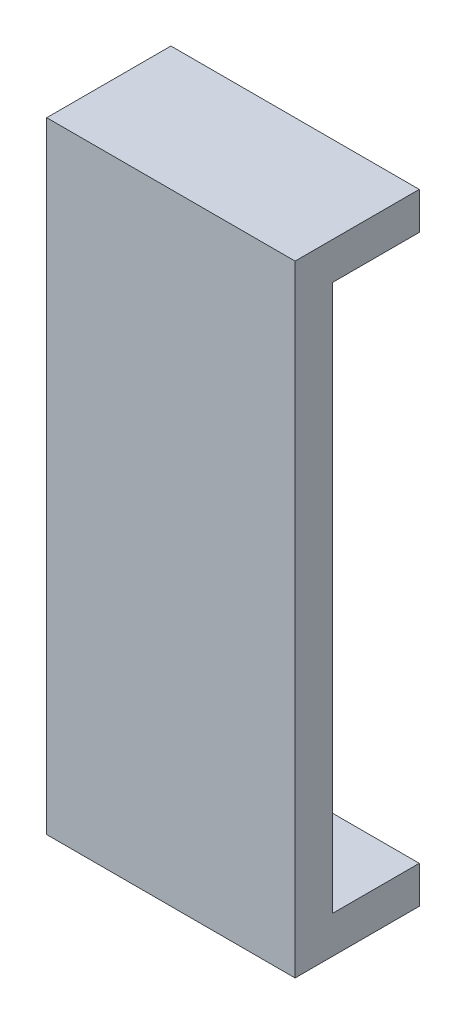
ISO-10303-21;
HEADER;
FILE_DESCRIPTION(('STEP AP214'),'2;1');
FILE_NAME('part.step','',(''),(''),'','','');
FILE_SCHEMA(('AUTOMOTIVE_DESIGN { 1 0 10303 214 1 1 1 1 }'));
ENDSEC;
DATA;
#1=APPLICATION_CONTEXT('core data for automotive mechanical design processes');
#2=APPLICATION_PROTOCOL_DEFINITION('international standard','automotive_design',2000,#1);
#3=PRODUCT_CONTEXT('',#1,'mechanical');
#4=PRODUCT('Part','Part','',(#3));
#5=PRODUCT_RELATED_PRODUCT_CATEGORY('part','',(#4));
#6=PRODUCT_DEFINITION_FORMATION('','',#4);
#7=PRODUCT_DEFINITION_CONTEXT('part definition',#1,'design');
#8=PRODUCT_DEFINITION('design','',#6,#7);
#9=PRODUCT_DEFINITION_SHAPE('','',#8);
#10=(LENGTH_UNIT() NAMED_UNIT(*) SI_UNIT(.MILLI.,.METRE.));
#11=(NAMED_UNIT(*) PLANE_ANGLE_UNIT() SI_UNIT($,.RADIAN.));
#12=(NAMED_UNIT(*) SI_UNIT($,.STERADIAN.) SOLID_ANGLE_UNIT());
#13=UNCERTAINTY_MEASURE_WITH_UNIT(LENGTH_MEASURE(1.E-05),#10,'distance_accuracy_value','');
#14=(GEOMETRIC_REPRESENTATION_CONTEXT(3) GLOBAL_UNCERTAINTY_ASSIGNED_CONTEXT((#13)) GLOBAL_UNIT_ASSIGNED_CONTEXT((#10,
#11,#12)) REPRESENTATION_CONTEXT('',''));
#15=CARTESIAN_POINT('',(0.,0.,0.));
#16=DIRECTION('',(0.,0.,1.));
#17=DIRECTION('',(1.,0.,0.));
#18=AXIS2_PLACEMENT_3D('',#15,#16,#17);
#19=CARTESIAN_POINT('',(0.,0.,0.));
#20=DIRECTION('',(0.,0.,1.));
#21=DIRECTION('',(1.,0.,0.));
#22=AXIS2_PLACEMENT_3D('',#19,#20,#21);
#23=PLANE('',#22);
#24=DIRECTION('',(1.,0.,0.));
#25=VECTOR('',#24,1.);
#26=CARTESIAN_POINT('',(-10.,-22.,0.));
#27=LINE('',#26,#25);
#28=CARTESIAN_POINT('',(-10.,-22.,0.));
#29=VERTEX_POINT('',#28);
#30=CARTESIAN_POINT('',(10.,-22.,0.));
#31=VERTEX_POINT('',#30);
#32=EDGE_CURVE('E121',#29,#31,#27,.T.);
#33=ORIENTED_EDGE('',*,*,#32,.F.);
#34=DIRECTION('',(0.,-1.,0.));
#35=VECTOR('',#34,1.);
#36=CARTESIAN_POINT('',(-10.,25.,0.));
#37=LINE('',#36,#35);
#38=CARTESIAN_POINT('',(-10.,22.,0.));
#39=VERTEX_POINT('',#38);
#40=EDGE_CURVE('E126',#39,#29,#37,.T.);
#41=ORIENTED_EDGE('',*,*,#40,.F.);
#42=DIRECTION('',(-1.,0.,0.));
#43=VECTOR('',#42,1.);
#44=CARTESIAN_POINT('',(9.99999999999999,22.,0.));
#45=LINE('',#44,#43);
#46=CARTESIAN_POINT('',(9.99999999999999,22.,0.));
#47=VERTEX_POINT('',#46);
#48=EDGE_CURVE('E127',#47,#39,#45,.T.);
#49=ORIENTED_EDGE('',*,*,#48,.F.);
#50=DIRECTION('',(0.,1.,0.));
#51=VECTOR('',#50,1.);
#52=CARTESIAN_POINT('',(9.99999999999999,25.,0.));
#53=LINE('',#52,#51);
#54=EDGE_CURVE('E37',#31,#47,#53,.T.);
#55=ORIENTED_EDGE('',*,*,#54,.F.);
#56=EDGE_LOOP('',(#33,#41,#49,#55));
#57=FACE_BOUND('',#56,.T.);
#58=ADVANCED_FACE('F33',(#57),#23,.F.);
#59=CARTESIAN_POINT('',(9.99999999999999,25.,3.));
#60=DIRECTION('',(-1.,0.,0.));
#61=DIRECTION('',(0.,-1.,0.));
#62=AXIS2_PLACEMENT_3D('',#59,#60,#61);
#63=PLANE('',#62);
#64=DIRECTION('',(0.,0.,-1.));
#65=VECTOR('',#64,1.);
#66=CARTESIAN_POINT('',(10.,-25.,3.));
#67=LINE('',#66,#65);
#68=CARTESIAN_POINT('',(10.,-25.,3.));
#69=VERTEX_POINT('',#68);
#70=CARTESIAN_POINT('',(10.,-25.,-7.));
#71=VERTEX_POINT('',#70);
#72=EDGE_CURVE('E167',#69,#71,#67,.T.);
#73=ORIENTED_EDGE('',*,*,#72,.T.);
#74=DIRECTION('',(0.,-1.,0.));
#75=VECTOR('',#74,1.);
#76=CARTESIAN_POINT('',(10.,-25.,-7.));
#77=LINE('',#76,#75);
#78=CARTESIAN_POINT('',(10.,-22.,-7.));
#79=VERTEX_POINT('',#78);
#80=EDGE_CURVE('E111',#79,#71,#77,.T.);
#81=ORIENTED_EDGE('',*,*,#80,.F.);
#82=DIRECTION('',(0.,0.,1.));
#83=VECTOR('',#82,1.);
#84=CARTESIAN_POINT('',(10.,-22.,-7.));
#85=LINE('',#84,#83);
#86=EDGE_CURVE('E107',#79,#31,#85,.T.);
#87=ORIENTED_EDGE('',*,*,#86,.T.);
#88=ORIENTED_EDGE('',*,*,#54,.T.);
#89=DIRECTION('',(0.,0.,1.));
#90=VECTOR('',#89,1.);
#91=CARTESIAN_POINT('',(9.99999999999999,22.,-7.));
#92=LINE('',#91,#90);
#93=CARTESIAN_POINT('',(9.99999999999999,22.,-7.));
#94=VERTEX_POINT('',#93);
#95=EDGE_CURVE('E154',#94,#47,#92,.T.);
#96=ORIENTED_EDGE('',*,*,#95,.F.);
#97=DIRECTION('',(0.,-1.,0.));
#98=VECTOR('',#97,1.);
#99=CARTESIAN_POINT('',(9.99999999999999,25.,-7.));
#100=LINE('',#99,#98);
#101=CARTESIAN_POINT('',(9.99999999999999,25.,-7.));
#102=VERTEX_POINT('',#101);
#103=EDGE_CURVE('E130',#102,#94,#100,.T.);
#104=ORIENTED_EDGE('',*,*,#103,.F.);
#105=DIRECTION('',(0.,0.,-1.));
#106=VECTOR('',#105,1.);
#107=CARTESIAN_POINT('',(9.99999999999999,25.,3.));
#108=LINE('',#107,#106);
#109=CARTESIAN_POINT('',(9.99999999999999,25.,3.));
#110=VERTEX_POINT('',#109);
#111=EDGE_CURVE('E11',#110,#102,#108,.T.);
#112=ORIENTED_EDGE('',*,*,#111,.F.);
#113=DIRECTION('',(0.,1.,0.));
#114=VECTOR('',#113,1.);
#115=CARTESIAN_POINT('',(9.99999999999999,25.,3.));
#116=LINE('',#115,#114);
#117=EDGE_CURVE('E148',#69,#110,#116,.T.);
#118=ORIENTED_EDGE('',*,*,#117,.F.);
#119=EDGE_LOOP('',(#73,#81,#87,#88,#96,#104,#112,#118));
#120=FACE_BOUND('',#119,.T.);
#121=ADVANCED_FACE('F35',(#120),#63,.F.);
#122=CARTESIAN_POINT('',(-10.,25.,3.));
#123=DIRECTION('',(0.,-1.,0.));
#124=DIRECTION('',(0.,0.,-1.));
#125=AXIS2_PLACEMENT_3D('',#122,#123,#124);
#126=PLANE('',#125);
#127=ORIENTED_EDGE('',*,*,#111,.T.);
#128=DIRECTION('',(1.,0.,0.));
#129=VECTOR('',#128,1.);
#130=CARTESIAN_POINT('',(9.99999999999999,25.,-7.));
#131=LINE('',#130,#129);
#132=CARTESIAN_POINT('',(-10.,25.,-7.));
#133=VERTEX_POINT('',#132);
#134=EDGE_CURVE('E142',#133,#102,#131,.T.);
#135=ORIENTED_EDGE('',*,*,#134,.F.);
#136=DIRECTION('',(0.,0.,-1.));
#137=VECTOR('',#136,1.);
#138=CARTESIAN_POINT('',(-10.,25.,3.));
#139=LINE('',#138,#137);
#140=CARTESIAN_POINT('',(-10.,25.,3.));
#141=VERTEX_POINT('',#140);
#142=EDGE_CURVE('E43',#141,#133,#139,.T.);
#143=ORIENTED_EDGE('',*,*,#142,.F.);
#144=DIRECTION('',(-1.,0.,0.));
#145=VECTOR('',#144,1.);
#146=CARTESIAN_POINT('',(-10.,25.,3.));
#147=LINE('',#146,#145);
#148=EDGE_CURVE('E160',#110,#141,#147,.T.);
#149=ORIENTED_EDGE('',*,*,#148,.F.);
#150=EDGE_LOOP('',(#127,#135,#143,#149));
#151=FACE_BOUND('',#150,.T.);
#152=ADVANCED_FACE('F182',(#151),#126,.F.);
#153=CARTESIAN_POINT('',(-10.,25.,3.));
#154=DIRECTION('',(1.,0.,0.));
#155=DIRECTION('',(0.,1.,0.));
#156=AXIS2_PLACEMENT_3D('',#153,#154,#155);
#157=PLANE('',#156);
#158=ORIENTED_EDGE('',*,*,#142,.T.);
#159=DIRECTION('',(0.,1.,0.));
#160=VECTOR('',#159,1.);
#161=CARTESIAN_POINT('',(-10.,25.,-7.));
#162=LINE('',#161,#160);
#163=CARTESIAN_POINT('',(-10.,22.,-7.));
#164=VERTEX_POINT('',#163);
#165=EDGE_CURVE('E139',#164,#133,#162,.T.);
#166=ORIENTED_EDGE('',*,*,#165,.F.);
#167=DIRECTION('',(0.,0.,1.));
#168=VECTOR('',#167,1.);
#169=CARTESIAN_POINT('',(-10.,22.,-7.));
#170=LINE('',#169,#168);
#171=EDGE_CURVE('E145',#164,#39,#170,.T.);
#172=ORIENTED_EDGE('',*,*,#171,.T.);
#173=ORIENTED_EDGE('',*,*,#40,.T.);
#174=DIRECTION('',(0.,0.,1.));
#175=VECTOR('',#174,1.);
#176=CARTESIAN_POINT('',(-10.,-22.,-7.));
#177=LINE('',#176,#175);
#178=CARTESIAN_POINT('',(-10.,-22.,-7.));
#179=VERTEX_POINT('',#178);
#180=EDGE_CURVE('E105',#179,#29,#177,.T.);
#181=ORIENTED_EDGE('',*,*,#180,.F.);
#182=DIRECTION('',(0.,1.,0.));
#183=VECTOR('',#182,1.);
#184=CARTESIAN_POINT('',(-10.,-25.,-7.));
#185=LINE('',#184,#183);
#186=CARTESIAN_POINT('',(-10.,-25.,-7.));
#187=VERTEX_POINT('',#186);
#188=EDGE_CURVE('E112',#187,#179,#185,.T.);
#189=ORIENTED_EDGE('',*,*,#188,.F.);
#190=DIRECTION('',(0.,0.,-1.));
#191=VECTOR('',#190,1.);
#192=CARTESIAN_POINT('',(-10.,-25.,3.));
#193=LINE('',#192,#191);
#194=CARTESIAN_POINT('',(-10.,-25.,3.));
#195=VERTEX_POINT('',#194);
#196=EDGE_CURVE('E172',#195,#187,#193,.T.);
#197=ORIENTED_EDGE('',*,*,#196,.F.);
#198=DIRECTION('',(0.,-1.,0.));
#199=VECTOR('',#198,1.);
#200=CARTESIAN_POINT('',(-10.,25.,3.));
#201=LINE('',#200,#199);
#202=EDGE_CURVE('E163',#141,#195,#201,.T.);
#203=ORIENTED_EDGE('',*,*,#202,.F.);
#204=EDGE_LOOP('',(#158,#166,#172,#173,#181,#189,#197,#203));
#205=FACE_BOUND('',#204,.T.);
#206=ADVANCED_FACE('F124',(#205),#157,.F.);
#207=CARTESIAN_POINT('',(-10.,-25.,3.));
#208=DIRECTION('',(0.,1.,0.));
#209=DIRECTION('',(0.,0.,1.));
#210=AXIS2_PLACEMENT_3D('',#207,#208,#209);
#211=PLANE('',#210);
#212=ORIENTED_EDGE('',*,*,#196,.T.);
#213=DIRECTION('',(-1.,0.,0.));
#214=VECTOR('',#213,1.);
#215=CARTESIAN_POINT('',(-10.,-25.,-7.));
#216=LINE('',#215,#214);
#217=EDGE_CURVE('E118',#71,#187,#216,.T.);
#218=ORIENTED_EDGE('',*,*,#217,.F.);
#219=ORIENTED_EDGE('',*,*,#72,.F.);
#220=DIRECTION('',(1.,0.,0.));
#221=VECTOR('',#220,1.);
#222=CARTESIAN_POINT('',(-10.,-25.,3.));
#223=LINE('',#222,#221);
#224=EDGE_CURVE('E58',#195,#69,#223,.T.);
#225=ORIENTED_EDGE('',*,*,#224,.F.);
#226=EDGE_LOOP('',(#212,#218,#219,#225));
#227=FACE_BOUND('',#226,.T.);
#228=ADVANCED_FACE('F185',(#227),#211,.F.);
#229=CARTESIAN_POINT('',(0.,0.,3.));
#230=DIRECTION('',(0.,0.,1.));
#231=DIRECTION('',(1.,0.,0.));
#232=AXIS2_PLACEMENT_3D('',#229,#230,#231);
#233=PLANE('',#232);
#234=ORIENTED_EDGE('',*,*,#117,.T.);
#235=ORIENTED_EDGE('',*,*,#148,.T.);
#236=ORIENTED_EDGE('',*,*,#202,.T.);
#237=ORIENTED_EDGE('',*,*,#224,.T.);
#238=EDGE_LOOP('',(#234,#235,#236,#237));
#239=FACE_BOUND('',#238,.T.);
#240=ADVANCED_FACE('F190',(#239),#233,.T.);
#241=CARTESIAN_POINT('',(9.99999999999999,22.,-7.));
#242=DIRECTION('',(0.,1.,0.));
#243=DIRECTION('',(0.,0.,1.));
#244=AXIS2_PLACEMENT_3D('',#241,#242,#243);
#245=PLANE('',#244);
#246=ORIENTED_EDGE('',*,*,#48,.T.);
#247=ORIENTED_EDGE('',*,*,#171,.F.);
#248=DIRECTION('',(-1.,0.,0.));
#249=VECTOR('',#248,1.);
#250=CARTESIAN_POINT('',(9.99999999999999,22.,-7.));
#251=LINE('',#250,#249);
#252=EDGE_CURVE('E137',#94,#164,#251,.T.);
#253=ORIENTED_EDGE('',*,*,#252,.F.);
#254=ORIENTED_EDGE('',*,*,#95,.T.);
#255=EDGE_LOOP('',(#246,#247,#253,#254));
#256=FACE_BOUND('',#255,.T.);
#257=ADVANCED_FACE('F188',(#256),#245,.F.);
#258=CARTESIAN_POINT('',(0.,0.,-7.));
#259=DIRECTION('',(0.,0.,-1.));
#260=DIRECTION('',(-1.,0.,0.));
#261=AXIS2_PLACEMENT_3D('',#258,#259,#260);
#262=PLANE('',#261);
#263=ORIENTED_EDGE('',*,*,#103,.T.);
#264=ORIENTED_EDGE('',*,*,#252,.T.);
#265=ORIENTED_EDGE('',*,*,#165,.T.);
#266=ORIENTED_EDGE('',*,*,#134,.T.);
#267=EDGE_LOOP('',(#263,#264,#265,#266));
#268=FACE_BOUND('',#267,.T.);
#269=ADVANCED_FACE('F179',(#268),#262,.T.);
#270=CARTESIAN_POINT('',(-10.,-22.,-7.));
#271=DIRECTION('',(0.,-1.,0.));
#272=DIRECTION('',(0.,0.,-1.));
#273=AXIS2_PLACEMENT_3D('',#270,#271,#272);
#274=PLANE('',#273);
#275=ORIENTED_EDGE('',*,*,#32,.T.);
#276=ORIENTED_EDGE('',*,*,#86,.F.);
#277=DIRECTION('',(1.,0.,0.));
#278=VECTOR('',#277,1.);
#279=CARTESIAN_POINT('',(-10.,-22.,-7.));
#280=LINE('',#279,#278);
#281=EDGE_CURVE('E101',#179,#79,#280,.T.);
#282=ORIENTED_EDGE('',*,*,#281,.F.);
#283=ORIENTED_EDGE('',*,*,#180,.T.);
#284=EDGE_LOOP('',(#275,#276,#282,#283));
#285=FACE_BOUND('',#284,.T.);
#286=ADVANCED_FACE('F103',(#285),#274,.F.);
#287=CARTESIAN_POINT('',(0.,0.,-7.));
#288=DIRECTION('',(0.,0.,-1.));
#289=DIRECTION('',(-1.,0.,0.));
#290=AXIS2_PLACEMENT_3D('',#287,#288,#289);
#291=PLANE('',#290);
#292=ORIENTED_EDGE('',*,*,#188,.T.);
#293=ORIENTED_EDGE('',*,*,#281,.T.);
#294=ORIENTED_EDGE('',*,*,#80,.T.);
#295=ORIENTED_EDGE('',*,*,#217,.T.);
#296=EDGE_LOOP('',(#292,#293,#294,#295));
#297=FACE_BOUND('',#296,.T.);
#298=ADVANCED_FACE('F116',(#297),#291,.T.);
#299=CLOSED_SHELL('',(#58,#121,#152,#206,#228,#240,#257,#269,#286,#298));
#300=MANIFOLD_SOLID_BREP('B2',#299);
#301=ADVANCED_BREP_SHAPE_REPRESENTATION('',(#18,#300),#14);
#302=SHAPE_DEFINITION_REPRESENTATION(#9,#301);
ENDSEC;
END-ISO-10303-21;
